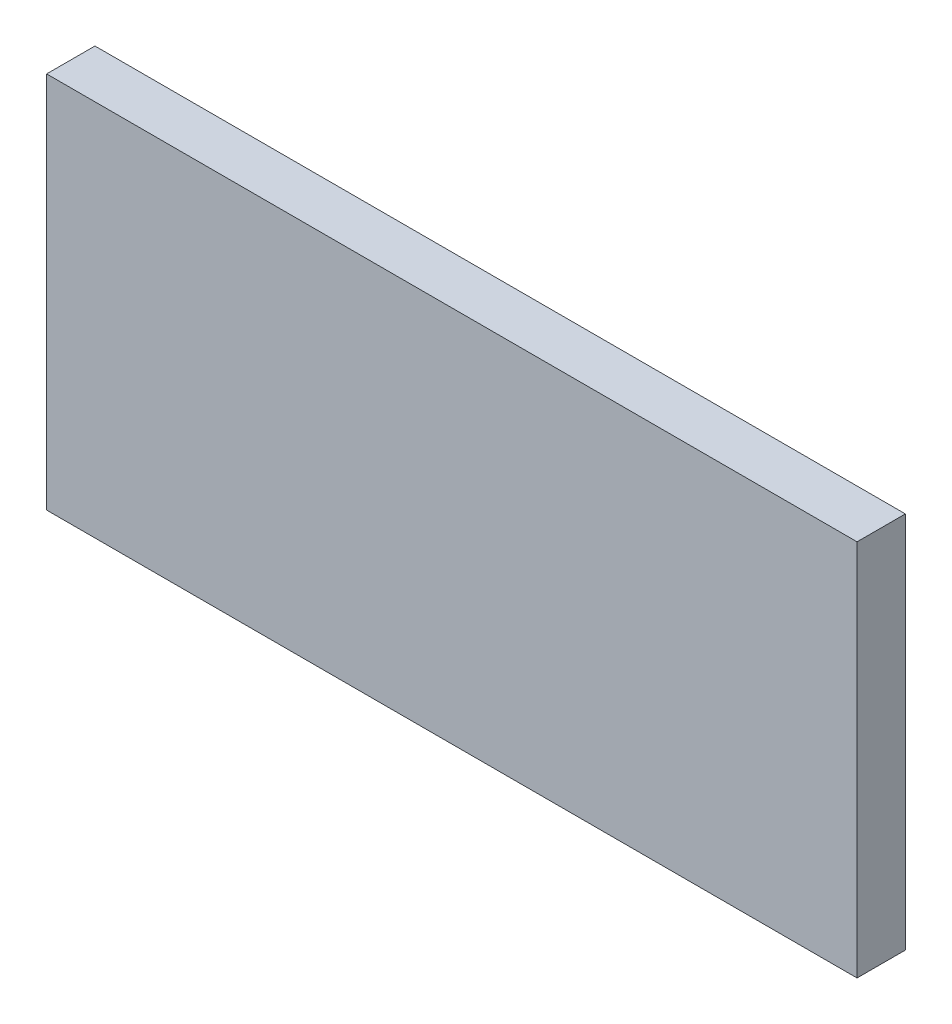
ISO-10303-21;
HEADER;
FILE_DESCRIPTION(('STEP AP214'),'2;1');
FILE_NAME('part.step','',(''),(''),'','','');
FILE_SCHEMA(('AUTOMOTIVE_DESIGN { 1 0 10303 214 1 1 1 1 }'));
ENDSEC;
DATA;
#1=APPLICATION_CONTEXT('core data for automotive mechanical design processes');
#2=APPLICATION_PROTOCOL_DEFINITION('international standard','automotive_design',2000,#1);
#3=PRODUCT_CONTEXT('',#1,'mechanical');
#4=PRODUCT('Part','Part','',(#3));
#5=PRODUCT_RELATED_PRODUCT_CATEGORY('part','',(#4));
#6=PRODUCT_DEFINITION_FORMATION('','',#4);
#7=PRODUCT_DEFINITION_CONTEXT('part definition',#1,'design');
#8=PRODUCT_DEFINITION('design','',#6,#7);
#9=PRODUCT_DEFINITION_SHAPE('','',#8);
#10=(LENGTH_UNIT() NAMED_UNIT(*) SI_UNIT(.MILLI.,.METRE.));
#11=(NAMED_UNIT(*) PLANE_ANGLE_UNIT() SI_UNIT($,.RADIAN.));
#12=(NAMED_UNIT(*) SI_UNIT($,.STERADIAN.) SOLID_ANGLE_UNIT());
#13=UNCERTAINTY_MEASURE_WITH_UNIT(LENGTH_MEASURE(1.E-05),#10,'distance_accuracy_value','');
#14=(GEOMETRIC_REPRESENTATION_CONTEXT(3) GLOBAL_UNCERTAINTY_ASSIGNED_CONTEXT((#13)) GLOBAL_UNIT_ASSIGNED_CONTEXT((#10,
#11,#12)) REPRESENTATION_CONTEXT('',''));
#15=CARTESIAN_POINT('',(0.,0.,0.));
#16=DIRECTION('',(0.,0.,1.));
#17=DIRECTION('',(1.,0.,0.));
#18=AXIS2_PLACEMENT_3D('',#15,#16,#17);
#19=CARTESIAN_POINT('',(184.5,86.,22.));
#20=DIRECTION('',(-1.,0.,0.));
#21=DIRECTION('',(0.,-1.,0.));
#22=AXIS2_PLACEMENT_3D('',#19,#20,#21);
#23=PLANE('',#22);
#24=DIRECTION('',(0.,1.,0.));
#25=VECTOR('',#24,1.);
#26=CARTESIAN_POINT('',(184.5,86.,0.));
#27=LINE('',#26,#25);
#28=CARTESIAN_POINT('',(184.5,-86.,0.));
#29=VERTEX_POINT('',#28);
#30=CARTESIAN_POINT('',(184.5,86.,0.));
#31=VERTEX_POINT('',#30);
#32=EDGE_CURVE('E96',#29,#31,#27,.T.);
#33=ORIENTED_EDGE('',*,*,#32,.T.);
#34=DIRECTION('',(0.,0.,-1.));
#35=VECTOR('',#34,1.);
#36=CARTESIAN_POINT('',(184.5,86.,22.));
#37=LINE('',#36,#35);
#38=CARTESIAN_POINT('',(184.5,86.,22.));
#39=VERTEX_POINT('',#38);
#40=EDGE_CURVE('E11',#39,#31,#37,.T.);
#41=ORIENTED_EDGE('',*,*,#40,.F.);
#42=DIRECTION('',(0.,1.,0.));
#43=VECTOR('',#42,1.);
#44=CARTESIAN_POINT('',(184.5,86.,22.));
#45=LINE('',#44,#43);
#46=CARTESIAN_POINT('',(184.5,-86.,22.));
#47=VERTEX_POINT('',#46);
#48=EDGE_CURVE('E84',#47,#39,#45,.T.);
#49=ORIENTED_EDGE('',*,*,#48,.F.);
#50=DIRECTION('',(0.,0.,-1.));
#51=VECTOR('',#50,1.);
#52=CARTESIAN_POINT('',(184.5,-86.,22.));
#53=LINE('',#52,#51);
#54=EDGE_CURVE('E92',#47,#29,#53,.T.);
#55=ORIENTED_EDGE('',*,*,#54,.T.);
#56=EDGE_LOOP('',(#33,#41,#49,#55));
#57=FACE_BOUND('',#56,.T.);
#58=ADVANCED_FACE('F33',(#57),#23,.F.);
#59=CARTESIAN_POINT('',(-184.5,86.,22.));
#60=DIRECTION('',(0.,-1.,0.));
#61=DIRECTION('',(0.,0.,-1.));
#62=AXIS2_PLACEMENT_3D('',#59,#60,#61);
#63=PLANE('',#62);
#64=DIRECTION('',(-1.,0.,0.));
#65=VECTOR('',#64,1.);
#66=CARTESIAN_POINT('',(-184.5,86.,0.));
#67=LINE('',#66,#65);
#68=CARTESIAN_POINT('',(-184.5,86.,0.));
#69=VERTEX_POINT('',#68);
#70=EDGE_CURVE('E88',#31,#69,#67,.T.);
#71=ORIENTED_EDGE('',*,*,#70,.T.);
#72=DIRECTION('',(0.,0.,-1.));
#73=VECTOR('',#72,1.);
#74=CARTESIAN_POINT('',(-184.5,86.,22.));
#75=LINE('',#74,#73);
#76=CARTESIAN_POINT('',(-184.5,86.,22.));
#77=VERTEX_POINT('',#76);
#78=EDGE_CURVE('E41',#77,#69,#75,.T.);
#79=ORIENTED_EDGE('',*,*,#78,.F.);
#80=DIRECTION('',(-1.,0.,0.));
#81=VECTOR('',#80,1.);
#82=CARTESIAN_POINT('',(-184.5,86.,22.));
#83=LINE('',#82,#81);
#84=EDGE_CURVE('E79',#39,#77,#83,.T.);
#85=ORIENTED_EDGE('',*,*,#84,.F.);
#86=ORIENTED_EDGE('',*,*,#40,.T.);
#87=EDGE_LOOP('',(#71,#79,#85,#86));
#88=FACE_BOUND('',#87,.T.);
#89=ADVANCED_FACE('F87',(#88),#63,.F.);
#90=CARTESIAN_POINT('',(-184.5,86.,22.));
#91=DIRECTION('',(1.,0.,0.));
#92=DIRECTION('',(0.,1.,0.));
#93=AXIS2_PLACEMENT_3D('',#90,#91,#92);
#94=PLANE('',#93);
#95=DIRECTION('',(0.,-1.,0.));
#96=VECTOR('',#95,1.);
#97=CARTESIAN_POINT('',(-184.5,86.,0.));
#98=LINE('',#97,#96);
#99=CARTESIAN_POINT('',(-184.5,-86.,0.));
#100=VERTEX_POINT('',#99);
#101=EDGE_CURVE('E66',#69,#100,#98,.T.);
#102=ORIENTED_EDGE('',*,*,#101,.T.);
#103=DIRECTION('',(0.,0.,-1.));
#104=VECTOR('',#103,1.);
#105=CARTESIAN_POINT('',(-184.5,-86.,22.));
#106=LINE('',#105,#104);
#107=CARTESIAN_POINT('',(-184.5,-86.,22.));
#108=VERTEX_POINT('',#107);
#109=EDGE_CURVE('E89',#108,#100,#106,.T.);
#110=ORIENTED_EDGE('',*,*,#109,.F.);
#111=DIRECTION('',(0.,-1.,0.));
#112=VECTOR('',#111,1.);
#113=CARTESIAN_POINT('',(-184.5,86.,22.));
#114=LINE('',#113,#112);
#115=EDGE_CURVE('E82',#77,#108,#114,.T.);
#116=ORIENTED_EDGE('',*,*,#115,.F.);
#117=ORIENTED_EDGE('',*,*,#78,.T.);
#118=EDGE_LOOP('',(#102,#110,#116,#117));
#119=FACE_BOUND('',#118,.T.);
#120=ADVANCED_FACE('F90',(#119),#94,.F.);
#121=CARTESIAN_POINT('',(-184.5,-86.,22.));
#122=DIRECTION('',(0.,1.,0.));
#123=DIRECTION('',(0.,0.,1.));
#124=AXIS2_PLACEMENT_3D('',#121,#122,#123);
#125=PLANE('',#124);
#126=DIRECTION('',(1.,0.,0.));
#127=VECTOR('',#126,1.);
#128=CARTESIAN_POINT('',(-184.5,-86.,0.));
#129=LINE('',#128,#127);
#130=EDGE_CURVE('E72',#100,#29,#129,.T.);
#131=ORIENTED_EDGE('',*,*,#130,.T.);
#132=ORIENTED_EDGE('',*,*,#54,.F.);
#133=DIRECTION('',(1.,0.,0.));
#134=VECTOR('',#133,1.);
#135=CARTESIAN_POINT('',(-184.5,-86.,22.));
#136=LINE('',#135,#134);
#137=EDGE_CURVE('E49',#108,#47,#136,.T.);
#138=ORIENTED_EDGE('',*,*,#137,.F.);
#139=ORIENTED_EDGE('',*,*,#109,.T.);
#140=EDGE_LOOP('',(#131,#132,#138,#139));
#141=FACE_BOUND('',#140,.T.);
#142=ADVANCED_FACE('F103',(#141),#125,.F.);
#143=CARTESIAN_POINT('',(0.,0.,22.));
#144=DIRECTION('',(0.,0.,1.));
#145=DIRECTION('',(1.,0.,0.));
#146=AXIS2_PLACEMENT_3D('',#143,#144,#145);
#147=PLANE('',#146);
#148=ORIENTED_EDGE('',*,*,#48,.T.);
#149=ORIENTED_EDGE('',*,*,#84,.T.);
#150=ORIENTED_EDGE('',*,*,#115,.T.);
#151=ORIENTED_EDGE('',*,*,#137,.T.);
#152=EDGE_LOOP('',(#148,#149,#150,#151));
#153=FACE_BOUND('',#152,.T.);
#154=ADVANCED_FACE('F80',(#153),#147,.T.);
#155=CARTESIAN_POINT('',(0.,0.,0.));
#156=DIRECTION('',(0.,0.,1.));
#157=DIRECTION('',(1.,0.,0.));
#158=AXIS2_PLACEMENT_3D('',#155,#156,#157);
#159=PLANE('',#158);
#160=ORIENTED_EDGE('',*,*,#32,.F.);
#161=ORIENTED_EDGE('',*,*,#130,.F.);
#162=ORIENTED_EDGE('',*,*,#101,.F.);
#163=ORIENTED_EDGE('',*,*,#70,.F.);
#164=EDGE_LOOP('',(#160,#161,#162,#163));
#165=FACE_BOUND('',#164,.T.);
#166=ADVANCED_FACE('F106',(#165),#159,.F.);
#167=CLOSED_SHELL('',(#58,#89,#120,#142,#154,#166));
#168=MANIFOLD_SOLID_BREP('B2',#167);
#169=ADVANCED_BREP_SHAPE_REPRESENTATION('',(#18,#168),#14);
#170=SHAPE_DEFINITION_REPRESENTATION(#9,#169);
ENDSEC;
END-ISO-10303-21;
